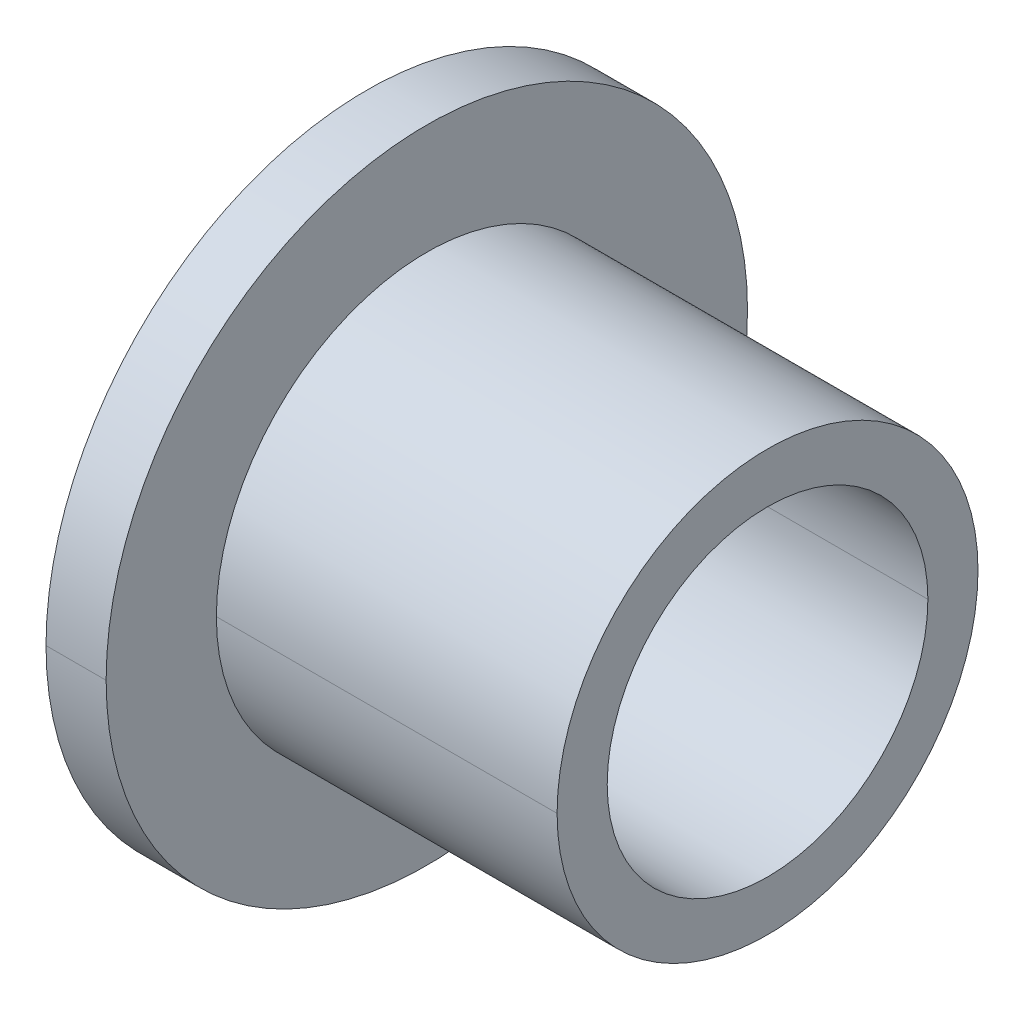
ISO-10303-21;
HEADER;
FILE_DESCRIPTION(('STEP AP214'),'2;1');
FILE_NAME('part.step','',(''),(''),'','','');
FILE_SCHEMA(('AUTOMOTIVE_DESIGN { 1 0 10303 214 1 1 1 1 }'));
ENDSEC;
DATA;
#1=APPLICATION_CONTEXT('core data for automotive mechanical design processes');
#2=APPLICATION_PROTOCOL_DEFINITION('international standard','automotive_design',2000,#1);
#3=PRODUCT_CONTEXT('',#1,'mechanical');
#4=PRODUCT('Part','Part','',(#3));
#5=PRODUCT_RELATED_PRODUCT_CATEGORY('part','',(#4));
#6=PRODUCT_DEFINITION_FORMATION('','',#4);
#7=PRODUCT_DEFINITION_CONTEXT('part definition',#1,'design');
#8=PRODUCT_DEFINITION('design','',#6,#7);
#9=PRODUCT_DEFINITION_SHAPE('','',#8);
#10=(LENGTH_UNIT() NAMED_UNIT(*) SI_UNIT(.MILLI.,.METRE.));
#11=(NAMED_UNIT(*) PLANE_ANGLE_UNIT() SI_UNIT($,.RADIAN.));
#12=(NAMED_UNIT(*) SI_UNIT($,.STERADIAN.) SOLID_ANGLE_UNIT());
#13=UNCERTAINTY_MEASURE_WITH_UNIT(LENGTH_MEASURE(1.E-05),#10,'distance_accuracy_value','');
#14=(GEOMETRIC_REPRESENTATION_CONTEXT(3) GLOBAL_UNCERTAINTY_ASSIGNED_CONTEXT((#13)) GLOBAL_UNIT_ASSIGNED_CONTEXT((#10,
#11,#12)) REPRESENTATION_CONTEXT('',''));
#15=CARTESIAN_POINT('',(0.,0.,0.));
#16=DIRECTION('',(0.,0.,1.));
#17=DIRECTION('',(1.,0.,0.));
#18=AXIS2_PLACEMENT_3D('',#15,#16,#17);
#19=CARTESIAN_POINT('',(0.,8.,0.));
#20=DIRECTION('',(-1.,0.,0.));
#21=DIRECTION('',(0.,0.,1.));
#22=AXIS2_PLACEMENT_3D('',#19,#20,#21);
#23=PLANE('',#22);
#24=CARTESIAN_POINT('',(0.,0.,0.));
#25=DIRECTION('',(1.,0.,0.));
#26=DIRECTION('',(0.,0.,-1.));
#27=AXIS2_PLACEMENT_3D('',#24,#25,#26);
#28=CIRCLE('',#27,4.);
#29=CARTESIAN_POINT('',(0.,0.,-4.));
#30=VERTEX_POINT('',#29);
#31=CARTESIAN_POINT('',(0.,0.,4.));
#32=VERTEX_POINT('',#31);
#33=EDGE_CURVE('E10',#30,#32,#28,.T.);
#34=ORIENTED_EDGE('',*,*,#33,.T.);
#35=CARTESIAN_POINT('',(0.,0.,0.));
#36=DIRECTION('',(1.,0.,0.));
#37=DIRECTION('',(0.,0.,-1.));
#38=AXIS2_PLACEMENT_3D('',#35,#36,#37);
#39=CIRCLE('',#38,4.);
#40=EDGE_CURVE('E24',#32,#30,#39,.T.);
#41=ORIENTED_EDGE('',*,*,#40,.T.);
#42=EDGE_LOOP('',(#34,#41));
#43=FACE_BOUND('',#42,.T.);
#44=CARTESIAN_POINT('',(0.,0.,0.));
#45=DIRECTION('',(1.,0.,0.));
#46=DIRECTION('',(0.,0.,-1.));
#47=AXIS2_PLACEMENT_3D('',#44,#45,#46);
#48=CIRCLE('',#47,8.);
#49=CARTESIAN_POINT('',(0.,0.,8.));
#50=VERTEX_POINT('',#49);
#51=CARTESIAN_POINT('',(0.,0.,-8.));
#52=VERTEX_POINT('',#51);
#53=EDGE_CURVE('E135',#50,#52,#48,.T.);
#54=ORIENTED_EDGE('',*,*,#53,.F.);
#55=CARTESIAN_POINT('',(0.,0.,0.));
#56=DIRECTION('',(1.,0.,0.));
#57=DIRECTION('',(0.,0.,-1.));
#58=AXIS2_PLACEMENT_3D('',#55,#56,#57);
#59=CIRCLE('',#58,8.);
#60=EDGE_CURVE('E130',#52,#50,#59,.T.);
#61=ORIENTED_EDGE('',*,*,#60,.F.);
#62=EDGE_LOOP('',(#54,#61));
#63=FACE_BOUND('',#62,.T.);
#64=ADVANCED_FACE('F16',(#43,#63),#23,.T.);
#65=CARTESIAN_POINT('',(10.,0.,0.));
#66=DIRECTION('',(1.,0.,0.));
#67=DIRECTION('',(0.,-1.,0.));
#68=AXIS2_PLACEMENT_3D('',#65,#66,#67);
#69=CYLINDRICAL_SURFACE('',#68,8.);
#70=DIRECTION('',(1.,0.,0.));
#71=VECTOR('',#70,1.);
#72=CARTESIAN_POINT('',(0.,0.,8.));
#73=LINE('',#72,#71);
#74=CARTESIAN_POINT('',(1.5,0.,8.));
#75=VERTEX_POINT('',#74);
#76=EDGE_CURVE('E126',#50,#75,#73,.T.);
#77=ORIENTED_EDGE('',*,*,#76,.T.);
#78=CARTESIAN_POINT('',(1.5,0.,0.));
#79=DIRECTION('',(1.,0.,0.));
#80=DIRECTION('',(0.,0.,-1.));
#81=AXIS2_PLACEMENT_3D('',#78,#79,#80);
#82=CIRCLE('',#81,8.);
#83=CARTESIAN_POINT('',(1.5,0.,-8.));
#84=VERTEX_POINT('',#83);
#85=EDGE_CURVE('E121',#84,#75,#82,.T.);
#86=ORIENTED_EDGE('',*,*,#85,.F.);
#87=DIRECTION('',(1.,0.,0.));
#88=VECTOR('',#87,1.);
#89=CARTESIAN_POINT('',(0.,0.,-8.));
#90=LINE('',#89,#88);
#91=EDGE_CURVE('E116',#52,#84,#90,.T.);
#92=ORIENTED_EDGE('',*,*,#91,.F.);
#93=ORIENTED_EDGE('',*,*,#60,.T.);
#94=EDGE_LOOP('',(#77,#86,#92,#93));
#95=FACE_BOUND('',#94,.T.);
#96=ADVANCED_FACE('F151',(#95),#69,.T.);
#97=CARTESIAN_POINT('',(10.,0.,0.));
#98=DIRECTION('',(1.,0.,0.));
#99=DIRECTION('',(0.,1.,0.));
#100=AXIS2_PLACEMENT_3D('',#97,#98,#99);
#101=CYLINDRICAL_SURFACE('',#100,8.);
#102=ORIENTED_EDGE('',*,*,#76,.F.);
#103=ORIENTED_EDGE('',*,*,#53,.T.);
#104=ORIENTED_EDGE('',*,*,#91,.T.);
#105=CARTESIAN_POINT('',(1.5,0.,0.));
#106=DIRECTION('',(1.,0.,0.));
#107=DIRECTION('',(0.,0.,-1.));
#108=AXIS2_PLACEMENT_3D('',#105,#106,#107);
#109=CIRCLE('',#108,8.);
#110=EDGE_CURVE('E111',#75,#84,#109,.T.);
#111=ORIENTED_EDGE('',*,*,#110,.F.);
#112=EDGE_LOOP('',(#102,#103,#104,#111));
#113=FACE_BOUND('',#112,.T.);
#114=ADVANCED_FACE('F146',(#113),#101,.T.);
#115=CARTESIAN_POINT('',(1.5,5.25,0.));
#116=DIRECTION('',(1.,0.,0.));
#117=DIRECTION('',(0.,0.,-1.));
#118=AXIS2_PLACEMENT_3D('',#115,#116,#117);
#119=PLANE('',#118);
#120=ORIENTED_EDGE('',*,*,#85,.T.);
#121=ORIENTED_EDGE('',*,*,#110,.T.);
#122=EDGE_LOOP('',(#120,#121));
#123=FACE_BOUND('',#122,.T.);
#124=CARTESIAN_POINT('',(1.5,0.,0.));
#125=DIRECTION('',(1.,0.,0.));
#126=DIRECTION('',(0.,0.,-1.));
#127=AXIS2_PLACEMENT_3D('',#124,#125,#126);
#128=CIRCLE('',#127,5.25);
#129=CARTESIAN_POINT('',(1.5,0.,5.25));
#130=VERTEX_POINT('',#129);
#131=CARTESIAN_POINT('',(1.5,0.,-5.25));
#132=VERTEX_POINT('',#131);
#133=EDGE_CURVE('E106',#130,#132,#128,.T.);
#134=ORIENTED_EDGE('',*,*,#133,.F.);
#135=CARTESIAN_POINT('',(1.5,0.,0.));
#136=DIRECTION('',(1.,0.,0.));
#137=DIRECTION('',(0.,0.,-1.));
#138=AXIS2_PLACEMENT_3D('',#135,#136,#137);
#139=CIRCLE('',#138,5.25);
#140=EDGE_CURVE('E101',#132,#130,#139,.T.);
#141=ORIENTED_EDGE('',*,*,#140,.F.);
#142=EDGE_LOOP('',(#134,#141));
#143=FACE_BOUND('',#142,.T.);
#144=ADVANCED_FACE('F153',(#123,#143),#119,.T.);
#145=CARTESIAN_POINT('',(10.,0.,0.));
#146=DIRECTION('',(1.,0.,0.));
#147=DIRECTION('',(0.,-1.,0.));
#148=AXIS2_PLACEMENT_3D('',#145,#146,#147);
#149=CYLINDRICAL_SURFACE('',#148,5.25);
#150=DIRECTION('',(1.,0.,0.));
#151=VECTOR('',#150,1.);
#152=CARTESIAN_POINT('',(1.5,0.,5.25));
#153=LINE('',#152,#151);
#154=CARTESIAN_POINT('',(10.,0.,5.25));
#155=VERTEX_POINT('',#154);
#156=EDGE_CURVE('E97',#130,#155,#153,.T.);
#157=ORIENTED_EDGE('',*,*,#156,.T.);
#158=CARTESIAN_POINT('',(10.,0.,0.));
#159=DIRECTION('',(1.,0.,0.));
#160=DIRECTION('',(0.,0.,-1.));
#161=AXIS2_PLACEMENT_3D('',#158,#159,#160);
#162=CIRCLE('',#161,5.25);
#163=CARTESIAN_POINT('',(10.,0.,-5.25));
#164=VERTEX_POINT('',#163);
#165=EDGE_CURVE('E92',#164,#155,#162,.T.);
#166=ORIENTED_EDGE('',*,*,#165,.F.);
#167=DIRECTION('',(1.,0.,0.));
#168=VECTOR('',#167,1.);
#169=CARTESIAN_POINT('',(1.5,0.,-5.25));
#170=LINE('',#169,#168);
#171=EDGE_CURVE('E81',#132,#164,#170,.T.);
#172=ORIENTED_EDGE('',*,*,#171,.F.);
#173=ORIENTED_EDGE('',*,*,#140,.T.);
#174=EDGE_LOOP('',(#157,#166,#172,#173));
#175=FACE_BOUND('',#174,.T.);
#176=ADVANCED_FACE('F156',(#175),#149,.T.);
#177=CARTESIAN_POINT('',(10.,0.,0.));
#178=DIRECTION('',(1.,0.,0.));
#179=DIRECTION('',(0.,1.,0.));
#180=AXIS2_PLACEMENT_3D('',#177,#178,#179);
#181=CYLINDRICAL_SURFACE('',#180,5.25);
#182=ORIENTED_EDGE('',*,*,#156,.F.);
#183=ORIENTED_EDGE('',*,*,#133,.T.);
#184=ORIENTED_EDGE('',*,*,#171,.T.);
#185=CARTESIAN_POINT('',(10.,0.,0.));
#186=DIRECTION('',(1.,0.,0.));
#187=DIRECTION('',(0.,0.,-1.));
#188=AXIS2_PLACEMENT_3D('',#185,#186,#187);
#189=CIRCLE('',#188,5.25);
#190=EDGE_CURVE('E78',#155,#164,#189,.T.);
#191=ORIENTED_EDGE('',*,*,#190,.F.);
#192=EDGE_LOOP('',(#182,#183,#184,#191));
#193=FACE_BOUND('',#192,.T.);
#194=ADVANCED_FACE('F162',(#193),#181,.T.);
#195=CARTESIAN_POINT('',(10.,4.,0.));
#196=DIRECTION('',(1.,0.,0.));
#197=DIRECTION('',(0.,0.,-1.));
#198=AXIS2_PLACEMENT_3D('',#195,#196,#197);
#199=PLANE('',#198);
#200=ORIENTED_EDGE('',*,*,#165,.T.);
#201=ORIENTED_EDGE('',*,*,#190,.T.);
#202=EDGE_LOOP('',(#200,#201));
#203=FACE_BOUND('',#202,.T.);
#204=CARTESIAN_POINT('',(10.,0.,0.));
#205=DIRECTION('',(1.,0.,0.));
#206=DIRECTION('',(0.,0.,-1.));
#207=AXIS2_PLACEMENT_3D('',#204,#205,#206);
#208=CIRCLE('',#207,4.);
#209=CARTESIAN_POINT('',(10.,0.,4.));
#210=VERTEX_POINT('',#209);
#211=CARTESIAN_POINT('',(10.,0.,-4.));
#212=VERTEX_POINT('',#211);
#213=EDGE_CURVE('E66',#210,#212,#208,.T.);
#214=ORIENTED_EDGE('',*,*,#213,.F.);
#215=CARTESIAN_POINT('',(10.,0.,0.));
#216=DIRECTION('',(1.,0.,0.));
#217=DIRECTION('',(0.,0.,-1.));
#218=AXIS2_PLACEMENT_3D('',#215,#216,#217);
#219=CIRCLE('',#218,4.);
#220=EDGE_CURVE('E62',#212,#210,#219,.T.);
#221=ORIENTED_EDGE('',*,*,#220,.F.);
#222=EDGE_LOOP('',(#214,#221));
#223=FACE_BOUND('',#222,.T.);
#224=ADVANCED_FACE('F64',(#203,#223),#199,.T.);
#225=CARTESIAN_POINT('',(10.,0.,0.));
#226=DIRECTION('',(1.,0.,0.));
#227=DIRECTION('',(0.,-1.,0.));
#228=AXIS2_PLACEMENT_3D('',#225,#226,#227);
#229=CYLINDRICAL_SURFACE('',#228,4.);
#230=DIRECTION('',(1.,0.,0.));
#231=VECTOR('',#230,1.);
#232=CARTESIAN_POINT('',(0.,0.,4.));
#233=LINE('',#232,#231);
#234=EDGE_CURVE('E70',#32,#210,#233,.T.);
#235=ORIENTED_EDGE('',*,*,#234,.F.);
#236=ORIENTED_EDGE('',*,*,#33,.F.);
#237=DIRECTION('',(1.,0.,0.));
#238=VECTOR('',#237,1.);
#239=CARTESIAN_POINT('',(0.,0.,-4.));
#240=LINE('',#239,#238);
#241=EDGE_CURVE('E73',#30,#212,#240,.T.);
#242=ORIENTED_EDGE('',*,*,#241,.T.);
#243=ORIENTED_EDGE('',*,*,#220,.T.);
#244=EDGE_LOOP('',(#235,#236,#242,#243));
#245=FACE_BOUND('',#244,.T.);
#246=ADVANCED_FACE('F74',(#245),#229,.F.);
#247=CARTESIAN_POINT('',(10.,0.,0.));
#248=DIRECTION('',(1.,0.,0.));
#249=DIRECTION('',(0.,1.,0.));
#250=AXIS2_PLACEMENT_3D('',#247,#248,#249);
#251=CYLINDRICAL_SURFACE('',#250,4.);
#252=ORIENTED_EDGE('',*,*,#234,.T.);
#253=ORIENTED_EDGE('',*,*,#213,.T.);
#254=ORIENTED_EDGE('',*,*,#241,.F.);
#255=ORIENTED_EDGE('',*,*,#40,.F.);
#256=EDGE_LOOP('',(#252,#253,#254,#255));
#257=FACE_BOUND('',#256,.T.);
#258=ADVANCED_FACE('F77',(#257),#251,.F.);
#259=CLOSED_SHELL('',(#64,#96,#114,#144,#176,#194,#224,#246,#258));
#260=MANIFOLD_SOLID_BREP('B1',#259);
#261=ADVANCED_BREP_SHAPE_REPRESENTATION('',(#18,#260),#14);
#262=SHAPE_DEFINITION_REPRESENTATION(#9,#261);
ENDSEC;
END-ISO-10303-21;
